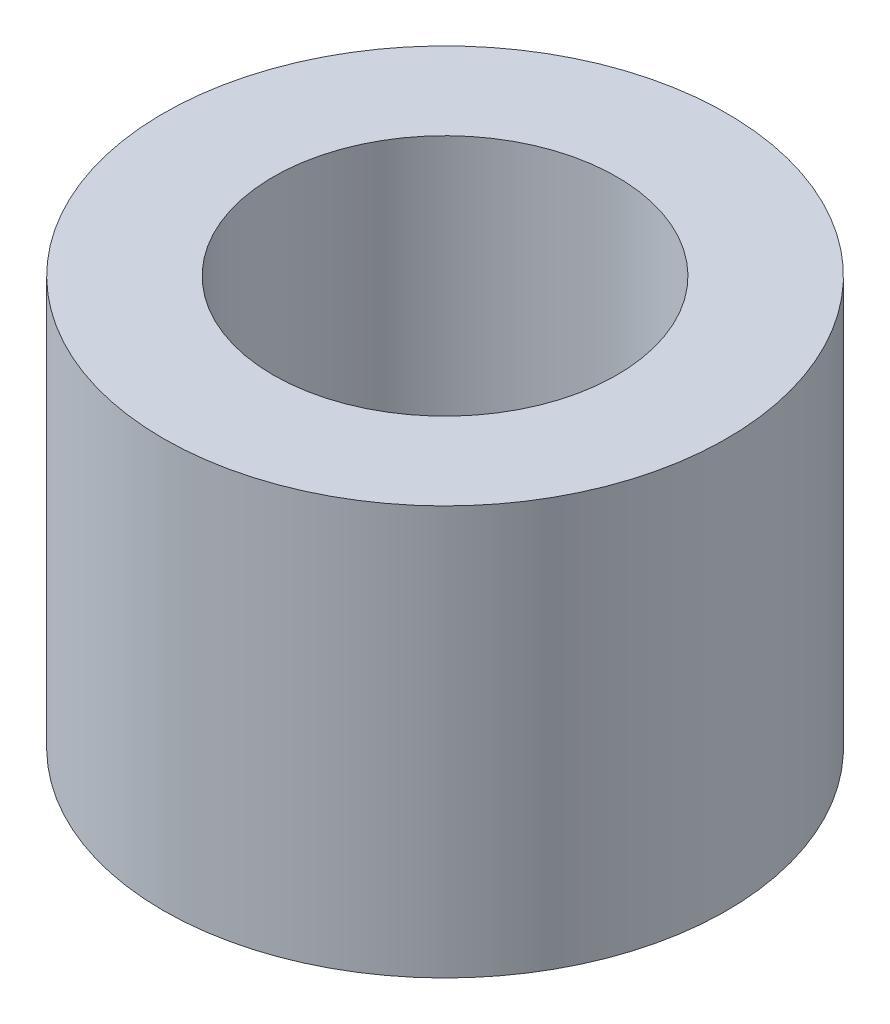
ISO-10303-21;
HEADER;
FILE_DESCRIPTION(('STEP AP214'),'2;1');
FILE_NAME('part.step','',(''),(''),'','','');
FILE_SCHEMA(('AUTOMOTIVE_DESIGN { 1 0 10303 214 1 1 1 1 }'));
ENDSEC;
DATA;
#1=APPLICATION_CONTEXT('core data for automotive mechanical design processes');
#2=APPLICATION_PROTOCOL_DEFINITION('international standard','automotive_design',2000,#1);
#3=PRODUCT_CONTEXT('',#1,'mechanical');
#4=PRODUCT('Part','Part','',(#3));
#5=PRODUCT_RELATED_PRODUCT_CATEGORY('part','',(#4));
#6=PRODUCT_DEFINITION_FORMATION('','',#4);
#7=PRODUCT_DEFINITION_CONTEXT('part definition',#1,'design');
#8=PRODUCT_DEFINITION('design','',#6,#7);
#9=PRODUCT_DEFINITION_SHAPE('','',#8);
#10=(LENGTH_UNIT() NAMED_UNIT(*) SI_UNIT(.MILLI.,.METRE.));
#11=(NAMED_UNIT(*) PLANE_ANGLE_UNIT() SI_UNIT($,.RADIAN.));
#12=(NAMED_UNIT(*) SI_UNIT($,.STERADIAN.) SOLID_ANGLE_UNIT());
#13=UNCERTAINTY_MEASURE_WITH_UNIT(LENGTH_MEASURE(1.E-05),#10,'distance_accuracy_value','');
#14=(GEOMETRIC_REPRESENTATION_CONTEXT(3) GLOBAL_UNCERTAINTY_ASSIGNED_CONTEXT((#13)) GLOBAL_UNIT_ASSIGNED_CONTEXT((#10,
#11,#12)) REPRESENTATION_CONTEXT('',''));
#15=CARTESIAN_POINT('',(0.,0.,0.));
#16=DIRECTION('',(0.,0.,1.));
#17=DIRECTION('',(1.,0.,0.));
#18=AXIS2_PLACEMENT_3D('',#15,#16,#17);
#19=CARTESIAN_POINT('',(59.4755457763826,5.95,-35.5700000008553));
#20=DIRECTION('',(0.,-1.,0.));
#21=DIRECTION('',(0.,0.,-1.));
#22=AXIS2_PLACEMENT_3D('',#19,#20,#21);
#23=CYLINDRICAL_SURFACE('',#22,4.09999999999999);
#24=CARTESIAN_POINT('',(59.4755457763826,5.95,-35.5700000008553));
#25=DIRECTION('',(0.,1.,0.));
#26=DIRECTION('',(0.,0.,1.));
#27=AXIS2_PLACEMENT_3D('',#24,#25,#26);
#28=CIRCLE('',#27,4.09999999999999);
#29=CARTESIAN_POINT('',(59.4755457763826,5.95,-31.4700000008553));
#30=VERTEX_POINT('',#29);
#31=EDGE_CURVE('E10',#30,#30,#28,.T.);
#32=ORIENTED_EDGE('',*,*,#31,.F.);
#33=EDGE_LOOP('',(#32));
#34=FACE_BOUND('',#33,.T.);
#35=CARTESIAN_POINT('',(59.4755457763826,0.,-35.5700000008553));
#36=DIRECTION('',(0.,1.,0.));
#37=DIRECTION('',(0.,0.,1.));
#38=AXIS2_PLACEMENT_3D('',#35,#36,#37);
#39=CIRCLE('',#38,4.09999999999999);
#40=CARTESIAN_POINT('',(59.4755457763826,0.,-31.4700000008553));
#41=VERTEX_POINT('',#40);
#42=EDGE_CURVE('E34',#41,#41,#39,.T.);
#43=ORIENTED_EDGE('',*,*,#42,.T.);
#44=EDGE_LOOP('',(#43));
#45=FACE_BOUND('',#44,.T.);
#46=ADVANCED_FACE('F31',(#34,#45),#23,.T.);
#47=CARTESIAN_POINT('',(59.4755457763826,5.95,-35.5700000008553));
#48=DIRECTION('',(0.,1.,0.));
#49=DIRECTION('',(0.,0.,1.));
#50=AXIS2_PLACEMENT_3D('',#47,#48,#49);
#51=PLANE('',#50);
#52=CARTESIAN_POINT('',(59.4755457763826,5.95,-35.5700000008553));
#53=DIRECTION('',(0.,1.,0.));
#54=DIRECTION('',(0.,0.,1.));
#55=AXIS2_PLACEMENT_3D('',#52,#53,#54);
#56=CIRCLE('',#55,2.49999999999999);
#57=CARTESIAN_POINT('',(59.4755457763826,5.95,-33.0700000008553));
#58=VERTEX_POINT('',#57);
#59=EDGE_CURVE('E45',#58,#58,#56,.T.);
#60=ORIENTED_EDGE('',*,*,#59,.F.);
#61=EDGE_LOOP('',(#60));
#62=FACE_BOUND('',#61,.T.);
#63=ORIENTED_EDGE('',*,*,#31,.T.);
#64=EDGE_LOOP('',(#63));
#65=FACE_BOUND('',#64,.T.);
#66=ADVANCED_FACE('F51',(#62,#65),#51,.T.);
#67=CARTESIAN_POINT('',(59.4755457763826,0.,-35.5700000008553));
#68=DIRECTION('',(0.,1.,0.));
#69=DIRECTION('',(0.,0.,1.));
#70=AXIS2_PLACEMENT_3D('',#67,#68,#69);
#71=PLANE('',#70);
#72=CARTESIAN_POINT('',(59.4755457763826,0.,-35.5700000008553));
#73=DIRECTION('',(0.,1.,0.));
#74=DIRECTION('',(0.,0.,1.));
#75=AXIS2_PLACEMENT_3D('',#72,#73,#74);
#76=CIRCLE('',#75,2.5);
#77=CARTESIAN_POINT('',(59.4755457763826,0.,-33.0700000008553));
#78=VERTEX_POINT('',#77);
#79=EDGE_CURVE('E41',#78,#78,#76,.T.);
#80=ORIENTED_EDGE('',*,*,#79,.T.);
#81=EDGE_LOOP('',(#80));
#82=FACE_BOUND('',#81,.T.);
#83=ORIENTED_EDGE('',*,*,#42,.F.);
#84=EDGE_LOOP('',(#83));
#85=FACE_BOUND('',#84,.T.);
#86=ADVANCED_FACE('F53',(#82,#85),#71,.F.);
#87=CARTESIAN_POINT('',(59.4755457763826,5.95,-35.5700000008553));
#88=DIRECTION('',(0.,1.,0.));
#89=DIRECTION('',(0.,0.,1.));
#90=AXIS2_PLACEMENT_3D('',#87,#88,#89);
#91=CYLINDRICAL_SURFACE('',#90,2.49999999999999);
#92=ORIENTED_EDGE('',*,*,#79,.F.);
#93=EDGE_LOOP('',(#92));
#94=FACE_BOUND('',#93,.T.);
#95=ORIENTED_EDGE('',*,*,#59,.T.);
#96=EDGE_LOOP('',(#95));
#97=FACE_BOUND('',#96,.T.);
#98=ADVANCED_FACE('F49',(#94,#97),#91,.F.);
#99=CLOSED_SHELL('',(#46,#66,#86,#98));
#100=MANIFOLD_SOLID_BREP('B2',#99);
#101=ADVANCED_BREP_SHAPE_REPRESENTATION('',(#18,#100),#14);
#102=SHAPE_DEFINITION_REPRESENTATION(#9,#101);
ENDSEC;
END-ISO-10303-21;
